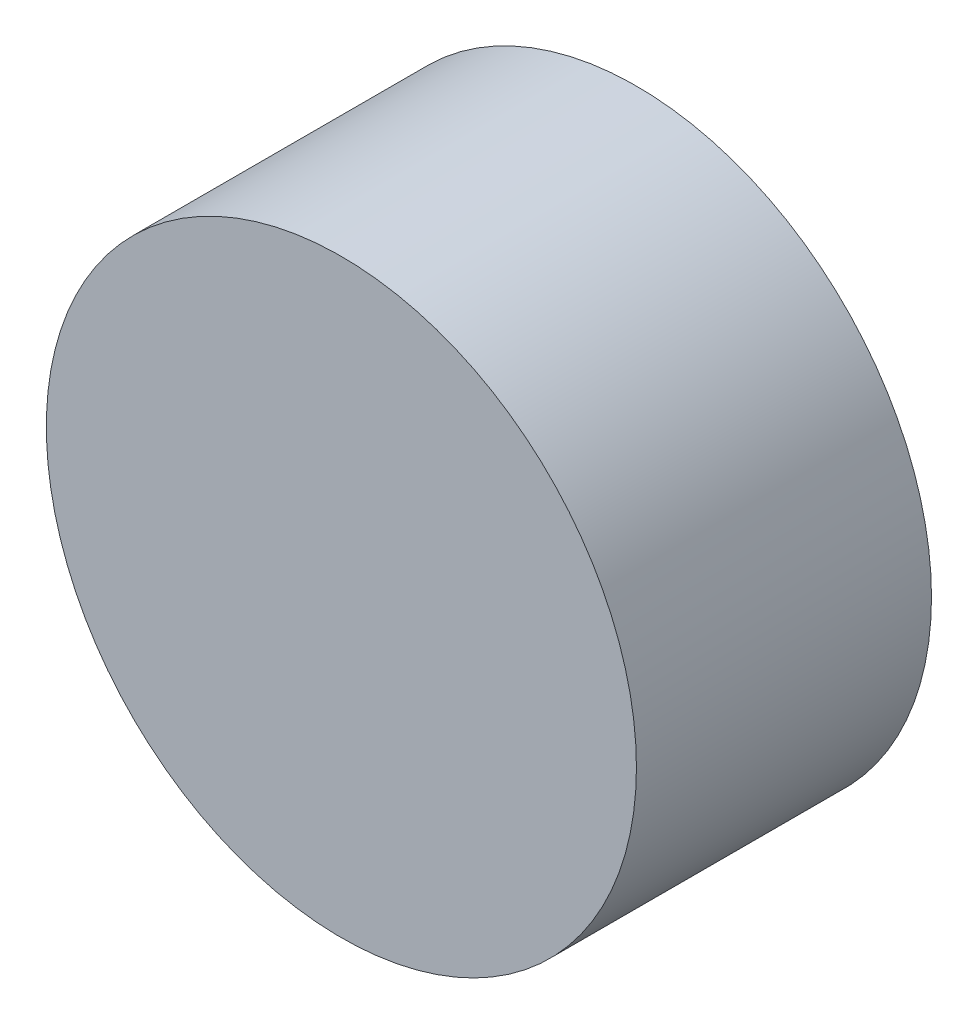
ISO-10303-21;
HEADER;
FILE_DESCRIPTION(('STEP AP214'),'2;1');
FILE_NAME('part.step','',(''),(''),'','','');
FILE_SCHEMA(('AUTOMOTIVE_DESIGN { 1 0 10303 214 1 1 1 1 }'));
ENDSEC;
DATA;
#1=APPLICATION_CONTEXT('core data for automotive mechanical design processes');
#2=APPLICATION_PROTOCOL_DEFINITION('international standard','automotive_design',2000,#1);
#3=PRODUCT_CONTEXT('',#1,'mechanical');
#4=PRODUCT('Part','Part','',(#3));
#5=PRODUCT_RELATED_PRODUCT_CATEGORY('part','',(#4));
#6=PRODUCT_DEFINITION_FORMATION('','',#4);
#7=PRODUCT_DEFINITION_CONTEXT('part definition',#1,'design');
#8=PRODUCT_DEFINITION('design','',#6,#7);
#9=PRODUCT_DEFINITION_SHAPE('','',#8);
#10=(LENGTH_UNIT() NAMED_UNIT(*) SI_UNIT(.MILLI.,.METRE.));
#11=(NAMED_UNIT(*) PLANE_ANGLE_UNIT() SI_UNIT($,.RADIAN.));
#12=(NAMED_UNIT(*) SI_UNIT($,.STERADIAN.) SOLID_ANGLE_UNIT());
#13=UNCERTAINTY_MEASURE_WITH_UNIT(LENGTH_MEASURE(1.E-05),#10,'distance_accuracy_value','');
#14=(GEOMETRIC_REPRESENTATION_CONTEXT(3) GLOBAL_UNCERTAINTY_ASSIGNED_CONTEXT((#13)) GLOBAL_UNIT_ASSIGNED_CONTEXT((#10,
#11,#12)) REPRESENTATION_CONTEXT('',''));
#15=CARTESIAN_POINT('',(0.,0.,0.));
#16=DIRECTION('',(0.,0.,1.));
#17=DIRECTION('',(1.,0.,0.));
#18=AXIS2_PLACEMENT_3D('',#15,#16,#17);
#19=CARTESIAN_POINT('',(-2.70595599561035,4.51610464107577,10.));
#20=DIRECTION('',(0.,0.,-1.));
#21=DIRECTION('',(-1.,0.,0.));
#22=AXIS2_PLACEMENT_3D('',#19,#20,#21);
#23=CYLINDRICAL_SURFACE('',#22,10.);
#24=CARTESIAN_POINT('',(-2.70595599561035,4.51610464107577,10.));
#25=DIRECTION('',(0.,0.,1.));
#26=DIRECTION('',(1.,0.,0.));
#27=AXIS2_PLACEMENT_3D('',#24,#25,#26);
#28=CIRCLE('',#27,10.);
#29=CARTESIAN_POINT('',(7.29404400438966,4.51610464107577,10.));
#30=VERTEX_POINT('',#29);
#31=EDGE_CURVE('E10',#30,#30,#28,.T.);
#32=ORIENTED_EDGE('',*,*,#31,.F.);
#33=EDGE_LOOP('',(#32));
#34=FACE_BOUND('',#33,.T.);
#35=CARTESIAN_POINT('',(-2.70595599561035,4.51610464107577,0.));
#36=DIRECTION('',(0.,0.,1.));
#37=DIRECTION('',(1.,0.,0.));
#38=AXIS2_PLACEMENT_3D('',#35,#36,#37);
#39=CIRCLE('',#38,10.);
#40=CARTESIAN_POINT('',(7.29404400438966,4.51610464107577,0.));
#41=VERTEX_POINT('',#40);
#42=EDGE_CURVE('E46',#41,#41,#39,.T.);
#43=ORIENTED_EDGE('',*,*,#42,.T.);
#44=EDGE_LOOP('',(#43));
#45=FACE_BOUND('',#44,.T.);
#46=ADVANCED_FACE('F43',(#34,#45),#23,.T.);
#47=CARTESIAN_POINT('',(-2.70595599561035,4.51610464107577,10.));
#48=DIRECTION('',(0.,0.,1.));
#49=DIRECTION('',(1.,0.,0.));
#50=AXIS2_PLACEMENT_3D('',#47,#48,#49);
#51=PLANE('',#50);
#52=ORIENTED_EDGE('',*,*,#31,.T.);
#53=EDGE_LOOP('',(#52));
#54=FACE_BOUND('',#53,.T.);
#55=ADVANCED_FACE('F60',(#54),#51,.T.);
#56=CARTESIAN_POINT('',(-2.70595599561035,4.51610464107577,0.));
#57=DIRECTION('',(0.,0.,1.));
#58=DIRECTION('',(1.,0.,0.));
#59=AXIS2_PLACEMENT_3D('',#56,#57,#58);
#60=PLANE('',#59);
#61=ORIENTED_EDGE('',*,*,#42,.F.);
#62=EDGE_LOOP('',(#61));
#63=FACE_BOUND('',#62,.T.);
#64=ADVANCED_FACE('F58',(#63),#60,.F.);
#65=CLOSED_SHELL('',(#46,#55,#64));
#66=MANIFOLD_SOLID_BREP('B2',#65);
#67=ADVANCED_BREP_SHAPE_REPRESENTATION('',(#18,#66),#14);
#68=SHAPE_DEFINITION_REPRESENTATION(#9,#67);
ENDSEC;
END-ISO-10303-21;
